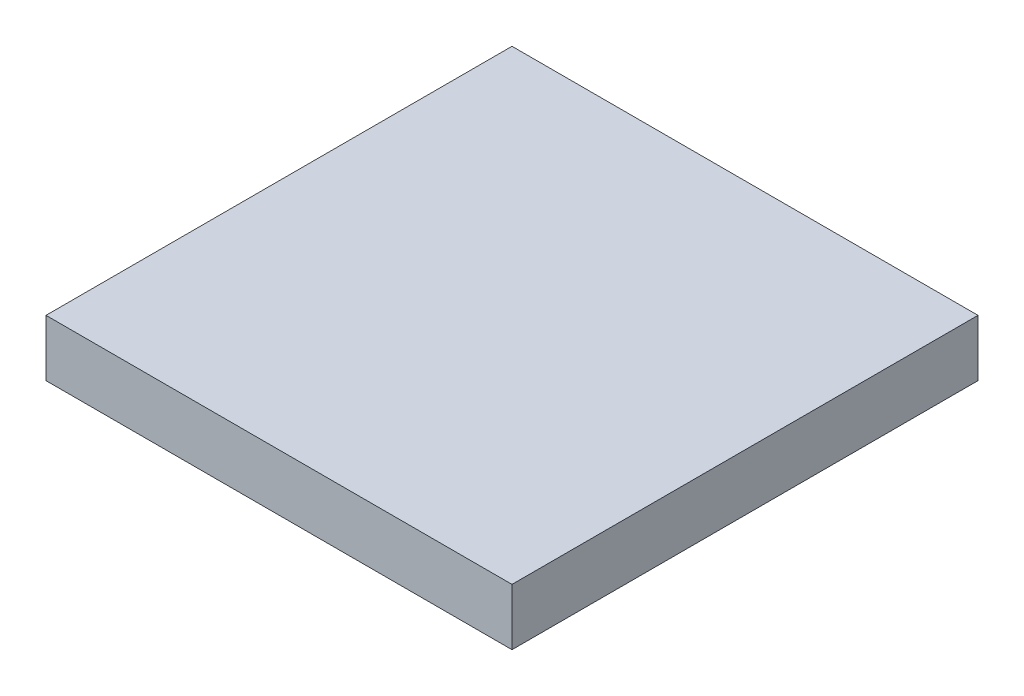
ISO-10303-21;
HEADER;
FILE_DESCRIPTION(('STEP AP214'),'2;1');
FILE_NAME('part.step','',(''),(''),'','','');
FILE_SCHEMA(('AUTOMOTIVE_DESIGN { 1 0 10303 214 1 1 1 1 }'));
ENDSEC;
DATA;
#1=APPLICATION_CONTEXT('core data for automotive mechanical design processes');
#2=APPLICATION_PROTOCOL_DEFINITION('international standard','automotive_design',2000,#1);
#3=PRODUCT_CONTEXT('',#1,'mechanical');
#4=PRODUCT('Part','Part','',(#3));
#5=PRODUCT_RELATED_PRODUCT_CATEGORY('part','',(#4));
#6=PRODUCT_DEFINITION_FORMATION('','',#4);
#7=PRODUCT_DEFINITION_CONTEXT('part definition',#1,'design');
#8=PRODUCT_DEFINITION('design','',#6,#7);
#9=PRODUCT_DEFINITION_SHAPE('','',#8);
#10=(LENGTH_UNIT() NAMED_UNIT(*) SI_UNIT(.MILLI.,.METRE.));
#11=(NAMED_UNIT(*) PLANE_ANGLE_UNIT() SI_UNIT($,.RADIAN.));
#12=(NAMED_UNIT(*) SI_UNIT($,.STERADIAN.) SOLID_ANGLE_UNIT());
#13=UNCERTAINTY_MEASURE_WITH_UNIT(LENGTH_MEASURE(1.E-05),#10,'distance_accuracy_value','');
#14=(GEOMETRIC_REPRESENTATION_CONTEXT(3) GLOBAL_UNCERTAINTY_ASSIGNED_CONTEXT((#13)) GLOBAL_UNIT_ASSIGNED_CONTEXT((#10,
#11,#12)) REPRESENTATION_CONTEXT('',''));
#15=CARTESIAN_POINT('',(0.,0.,0.));
#16=DIRECTION('',(0.,0.,1.));
#17=DIRECTION('',(1.,0.,0.));
#18=AXIS2_PLACEMENT_3D('',#15,#16,#17);
#19=CARTESIAN_POINT('',(0.,0.85,0.));
#20=DIRECTION('',(1.,0.,0.));
#21=DIRECTION('',(0.,0.,-1.));
#22=AXIS2_PLACEMENT_3D('',#19,#20,#21);
#23=PLANE('',#22);
#24=DIRECTION('',(0.,0.,1.));
#25=VECTOR('',#24,1.);
#26=CARTESIAN_POINT('',(0.,0.,0.));
#27=LINE('',#26,#25);
#28=CARTESIAN_POINT('',(0.,0.,-7.));
#29=VERTEX_POINT('',#28);
#30=CARTESIAN_POINT('',(0.,0.,0.));
#31=VERTEX_POINT('',#30);
#32=EDGE_CURVE('E97',#29,#31,#27,.T.);
#33=ORIENTED_EDGE('',*,*,#32,.T.);
#34=DIRECTION('',(0.,-1.,0.));
#35=VECTOR('',#34,1.);
#36=CARTESIAN_POINT('',(0.,0.85,0.));
#37=LINE('',#36,#35);
#38=CARTESIAN_POINT('',(0.,0.85,0.));
#39=VERTEX_POINT('',#38);
#40=EDGE_CURVE('E11',#39,#31,#37,.T.);
#41=ORIENTED_EDGE('',*,*,#40,.F.);
#42=DIRECTION('',(0.,0.,1.));
#43=VECTOR('',#42,1.);
#44=CARTESIAN_POINT('',(0.,0.85,0.));
#45=LINE('',#44,#43);
#46=CARTESIAN_POINT('',(0.,0.85,-7.));
#47=VERTEX_POINT('',#46);
#48=EDGE_CURVE('E85',#47,#39,#45,.T.);
#49=ORIENTED_EDGE('',*,*,#48,.F.);
#50=DIRECTION('',(0.,-1.,0.));
#51=VECTOR('',#50,1.);
#52=CARTESIAN_POINT('',(0.,0.85,-7.));
#53=LINE('',#52,#51);
#54=EDGE_CURVE('E93',#47,#29,#53,.T.);
#55=ORIENTED_EDGE('',*,*,#54,.T.);
#56=EDGE_LOOP('',(#33,#41,#49,#55));
#57=FACE_BOUND('',#56,.T.);
#58=ADVANCED_FACE('F34',(#57),#23,.F.);
#59=CARTESIAN_POINT('',(0.,0.85,0.));
#60=DIRECTION('',(0.,0.,-1.));
#61=DIRECTION('',(-1.,0.,0.));
#62=AXIS2_PLACEMENT_3D('',#59,#60,#61);
#63=PLANE('',#62);
#64=DIRECTION('',(1.,0.,0.));
#65=VECTOR('',#64,1.);
#66=CARTESIAN_POINT('',(0.,0.,0.));
#67=LINE('',#66,#65);
#68=CARTESIAN_POINT('',(7.,0.,0.));
#69=VERTEX_POINT('',#68);
#70=EDGE_CURVE('E89',#31,#69,#67,.T.);
#71=ORIENTED_EDGE('',*,*,#70,.T.);
#72=DIRECTION('',(0.,-1.,0.));
#73=VECTOR('',#72,1.);
#74=CARTESIAN_POINT('',(7.,0.85,0.));
#75=LINE('',#74,#73);
#76=CARTESIAN_POINT('',(7.,0.85,0.));
#77=VERTEX_POINT('',#76);
#78=EDGE_CURVE('E42',#77,#69,#75,.T.);
#79=ORIENTED_EDGE('',*,*,#78,.F.);
#80=DIRECTION('',(1.,0.,0.));
#81=VECTOR('',#80,1.);
#82=CARTESIAN_POINT('',(0.,0.85,0.));
#83=LINE('',#82,#81);
#84=EDGE_CURVE('E80',#39,#77,#83,.T.);
#85=ORIENTED_EDGE('',*,*,#84,.F.);
#86=ORIENTED_EDGE('',*,*,#40,.T.);
#87=EDGE_LOOP('',(#71,#79,#85,#86));
#88=FACE_BOUND('',#87,.T.);
#89=ADVANCED_FACE('F88',(#88),#63,.F.);
#90=CARTESIAN_POINT('',(7.,0.85,0.));
#91=DIRECTION('',(-1.,0.,0.));
#92=DIRECTION('',(0.,0.,1.));
#93=AXIS2_PLACEMENT_3D('',#90,#91,#92);
#94=PLANE('',#93);
#95=DIRECTION('',(0.,0.,-1.));
#96=VECTOR('',#95,1.);
#97=CARTESIAN_POINT('',(7.,0.,0.));
#98=LINE('',#97,#96);
#99=CARTESIAN_POINT('',(7.,0.,-7.));
#100=VERTEX_POINT('',#99);
#101=EDGE_CURVE('E67',#69,#100,#98,.T.);
#102=ORIENTED_EDGE('',*,*,#101,.T.);
#103=DIRECTION('',(0.,-1.,0.));
#104=VECTOR('',#103,1.);
#105=CARTESIAN_POINT('',(7.,0.85,-7.));
#106=LINE('',#105,#104);
#107=CARTESIAN_POINT('',(7.,0.85,-7.));
#108=VERTEX_POINT('',#107);
#109=EDGE_CURVE('E90',#108,#100,#106,.T.);
#110=ORIENTED_EDGE('',*,*,#109,.F.);
#111=DIRECTION('',(0.,0.,-1.));
#112=VECTOR('',#111,1.);
#113=CARTESIAN_POINT('',(7.,0.85,0.));
#114=LINE('',#113,#112);
#115=EDGE_CURVE('E83',#77,#108,#114,.T.);
#116=ORIENTED_EDGE('',*,*,#115,.F.);
#117=ORIENTED_EDGE('',*,*,#78,.T.);
#118=EDGE_LOOP('',(#102,#110,#116,#117));
#119=FACE_BOUND('',#118,.T.);
#120=ADVANCED_FACE('F91',(#119),#94,.F.);
#121=CARTESIAN_POINT('',(0.,0.85,-7.));
#122=DIRECTION('',(0.,0.,1.));
#123=DIRECTION('',(1.,0.,0.));
#124=AXIS2_PLACEMENT_3D('',#121,#122,#123);
#125=PLANE('',#124);
#126=DIRECTION('',(-1.,0.,0.));
#127=VECTOR('',#126,1.);
#128=CARTESIAN_POINT('',(0.,0.,-7.));
#129=LINE('',#128,#127);
#130=EDGE_CURVE('E73',#100,#29,#129,.T.);
#131=ORIENTED_EDGE('',*,*,#130,.T.);
#132=ORIENTED_EDGE('',*,*,#54,.F.);
#133=DIRECTION('',(-1.,0.,0.));
#134=VECTOR('',#133,1.);
#135=CARTESIAN_POINT('',(0.,0.85,-7.));
#136=LINE('',#135,#134);
#137=EDGE_CURVE('E50',#108,#47,#136,.T.);
#138=ORIENTED_EDGE('',*,*,#137,.F.);
#139=ORIENTED_EDGE('',*,*,#109,.T.);
#140=EDGE_LOOP('',(#131,#132,#138,#139));
#141=FACE_BOUND('',#140,.T.);
#142=ADVANCED_FACE('F104',(#141),#125,.F.);
#143=CARTESIAN_POINT('',(0.,0.85,0.));
#144=DIRECTION('',(0.,-1.,0.));
#145=DIRECTION('',(0.,0.,-1.));
#146=AXIS2_PLACEMENT_3D('',#143,#144,#145);
#147=PLANE('',#146);
#148=ORIENTED_EDGE('',*,*,#48,.T.);
#149=ORIENTED_EDGE('',*,*,#84,.T.);
#150=ORIENTED_EDGE('',*,*,#115,.T.);
#151=ORIENTED_EDGE('',*,*,#137,.T.);
#152=EDGE_LOOP('',(#148,#149,#150,#151));
#153=FACE_BOUND('',#152,.T.);
#154=ADVANCED_FACE('F81',(#153),#147,.F.);
#155=CARTESIAN_POINT('',(0.,0.,0.));
#156=DIRECTION('',(0.,-1.,0.));
#157=DIRECTION('',(0.,0.,-1.));
#158=AXIS2_PLACEMENT_3D('',#155,#156,#157);
#159=PLANE('',#158);
#160=ORIENTED_EDGE('',*,*,#32,.F.);
#161=ORIENTED_EDGE('',*,*,#130,.F.);
#162=ORIENTED_EDGE('',*,*,#101,.F.);
#163=ORIENTED_EDGE('',*,*,#70,.F.);
#164=EDGE_LOOP('',(#160,#161,#162,#163));
#165=FACE_BOUND('',#164,.T.);
#166=ADVANCED_FACE('F107',(#165),#159,.T.);
#167=CLOSED_SHELL('',(#58,#89,#120,#142,#154,#166));
#168=MANIFOLD_SOLID_BREP('B2',#167);
#169=ADVANCED_BREP_SHAPE_REPRESENTATION('',(#18,#168),#14);
#170=SHAPE_DEFINITION_REPRESENTATION(#9,#169);
ENDSEC;
END-ISO-10303-21;
